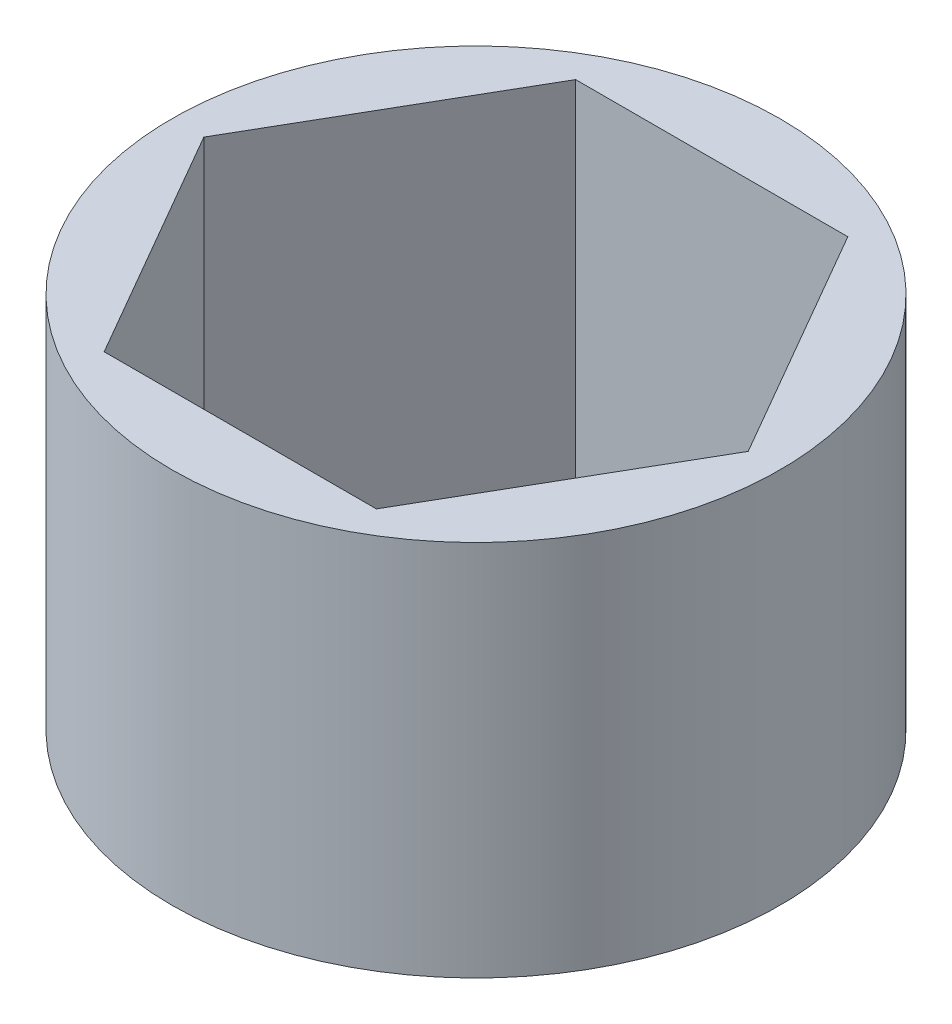
ISO-10303-21;
HEADER;
FILE_DESCRIPTION(('STEP AP214'),'2;1');
FILE_NAME('part.step','',(''),(''),'','','');
FILE_SCHEMA(('AUTOMOTIVE_DESIGN { 1 0 10303 214 1 1 1 1 }'));
ENDSEC;
DATA;
#1=APPLICATION_CONTEXT('core data for automotive mechanical design processes');
#2=APPLICATION_PROTOCOL_DEFINITION('international standard','automotive_design',2000,#1);
#3=PRODUCT_CONTEXT('',#1,'mechanical');
#4=PRODUCT('Part','Part','',(#3));
#5=PRODUCT_RELATED_PRODUCT_CATEGORY('part','',(#4));
#6=PRODUCT_DEFINITION_FORMATION('','',#4);
#7=PRODUCT_DEFINITION_CONTEXT('part definition',#1,'design');
#8=PRODUCT_DEFINITION('design','',#6,#7);
#9=PRODUCT_DEFINITION_SHAPE('','',#8);
#10=(LENGTH_UNIT() NAMED_UNIT(*) SI_UNIT(.MILLI.,.METRE.));
#11=(NAMED_UNIT(*) PLANE_ANGLE_UNIT() SI_UNIT($,.RADIAN.));
#12=(NAMED_UNIT(*) SI_UNIT($,.STERADIAN.) SOLID_ANGLE_UNIT());
#13=UNCERTAINTY_MEASURE_WITH_UNIT(LENGTH_MEASURE(1.E-05),#10,'distance_accuracy_value','');
#14=(GEOMETRIC_REPRESENTATION_CONTEXT(3) GLOBAL_UNCERTAINTY_ASSIGNED_CONTEXT((#13)) GLOBAL_UNIT_ASSIGNED_CONTEXT((#10,
#11,#12)) REPRESENTATION_CONTEXT('',''));
#15=CARTESIAN_POINT('',(0.,0.,0.));
#16=DIRECTION('',(0.,0.,1.));
#17=DIRECTION('',(1.,0.,0.));
#18=AXIS2_PLACEMENT_3D('',#15,#16,#17);
#19=CARTESIAN_POINT('',(0.,10.16,0.));
#20=DIRECTION('',(0.,1.,0.));
#21=DIRECTION('',(0.,0.,1.));
#22=AXIS2_PLACEMENT_3D('',#19,#20,#21);
#23=PLANE('',#22);
#24=CARTESIAN_POINT('',(0.,10.16,0.));
#25=DIRECTION('',(0.,1.,0.));
#26=DIRECTION('',(0.,0.,1.));
#27=AXIS2_PLACEMENT_3D('',#24,#25,#26);
#28=CIRCLE('',#27,8.1915);
#29=CARTESIAN_POINT('',(0.,10.16,8.1915));
#30=VERTEX_POINT('',#29);
#31=EDGE_CURVE('E11',#30,#30,#28,.T.);
#32=ORIENTED_EDGE('',*,*,#31,.T.);
#33=EDGE_LOOP('',(#32));
#34=FACE_BOUND('',#33,.T.);
#35=DIRECTION('',(-1.,0.,0.));
#36=VECTOR('',#35,1.);
#37=CARTESIAN_POINT('',(3.66617420935412,10.16,-6.35));
#38=LINE('',#37,#36);
#39=CARTESIAN_POINT('',(3.66617420935412,10.16,-6.35));
#40=VERTEX_POINT('',#39);
#41=CARTESIAN_POINT('',(-3.66617420935412,10.16,-6.35));
#42=VERTEX_POINT('',#41);
#43=EDGE_CURVE('E94',#40,#42,#38,.T.);
#44=ORIENTED_EDGE('',*,*,#43,.F.);
#45=DIRECTION('',(-0.5,0.,-0.866025403784438));
#46=VECTOR('',#45,1.);
#47=CARTESIAN_POINT('',(7.33234841870825,10.16,0.));
#48=LINE('',#47,#46);
#49=CARTESIAN_POINT('',(7.33234841870825,10.16,0.));
#50=VERTEX_POINT('',#49);
#51=EDGE_CURVE('E86',#50,#40,#48,.T.);
#52=ORIENTED_EDGE('',*,*,#51,.F.);
#53=DIRECTION('',(0.5,0.,-0.866025403784439));
#54=VECTOR('',#53,1.);
#55=CARTESIAN_POINT('',(3.66617420935412,10.16,6.35));
#56=LINE('',#55,#54);
#57=CARTESIAN_POINT('',(3.66617420935412,10.16,6.35));
#58=VERTEX_POINT('',#57);
#59=EDGE_CURVE('E114',#58,#50,#56,.T.);
#60=ORIENTED_EDGE('',*,*,#59,.F.);
#61=DIRECTION('',(1.,0.,0.));
#62=VECTOR('',#61,1.);
#63=CARTESIAN_POINT('',(-3.66617420935412,10.16,6.35));
#64=LINE('',#63,#62);
#65=CARTESIAN_POINT('',(-3.66617420935412,10.16,6.35));
#66=VERTEX_POINT('',#65);
#67=EDGE_CURVE('E112',#66,#58,#64,.T.);
#68=ORIENTED_EDGE('',*,*,#67,.F.);
#69=DIRECTION('',(0.5,0.,0.866025403784438));
#70=VECTOR('',#69,1.);
#71=CARTESIAN_POINT('',(-7.33234841870824,10.16,0.));
#72=LINE('',#71,#70);
#73=CARTESIAN_POINT('',(-7.33234841870824,10.16,0.));
#74=VERTEX_POINT('',#73);
#75=EDGE_CURVE('E108',#74,#66,#72,.T.);
#76=ORIENTED_EDGE('',*,*,#75,.F.);
#77=DIRECTION('',(-0.5,0.,0.866025403784439));
#78=VECTOR('',#77,1.);
#79=CARTESIAN_POINT('',(-3.66617420935412,10.16,-6.35));
#80=LINE('',#79,#78);
#81=EDGE_CURVE('E106',#42,#74,#80,.T.);
#82=ORIENTED_EDGE('',*,*,#81,.F.);
#83=EDGE_LOOP('',(#44,#52,#60,#68,#76,#82));
#84=FACE_BOUND('',#83,.T.);
#85=ADVANCED_FACE('F33',(#34,#84),#23,.T.);
#86=CARTESIAN_POINT('',(0.,0.,0.));
#87=DIRECTION('',(0.,1.,0.));
#88=DIRECTION('',(0.,0.,1.));
#89=AXIS2_PLACEMENT_3D('',#86,#87,#88);
#90=PLANE('',#89);
#91=CARTESIAN_POINT('',(0.,0.,0.));
#92=DIRECTION('',(0.,1.,0.));
#93=DIRECTION('',(0.,0.,1.));
#94=AXIS2_PLACEMENT_3D('',#91,#92,#93);
#95=CIRCLE('',#94,8.1915);
#96=CARTESIAN_POINT('',(0.,0.,8.1915));
#97=VERTEX_POINT('',#96);
#98=EDGE_CURVE('E37',#97,#97,#95,.T.);
#99=ORIENTED_EDGE('',*,*,#98,.F.);
#100=EDGE_LOOP('',(#99));
#101=FACE_BOUND('',#100,.T.);
#102=DIRECTION('',(-0.5,0.,-0.866025403784438));
#103=VECTOR('',#102,1.);
#104=CARTESIAN_POINT('',(7.33234841870825,0.,0.));
#105=LINE('',#104,#103);
#106=CARTESIAN_POINT('',(7.33234841870825,0.,0.));
#107=VERTEX_POINT('',#106);
#108=CARTESIAN_POINT('',(3.66617420935412,0.,-6.35));
#109=VERTEX_POINT('',#108);
#110=EDGE_CURVE('E56',#107,#109,#105,.T.);
#111=ORIENTED_EDGE('',*,*,#110,.T.);
#112=DIRECTION('',(-1.,0.,0.));
#113=VECTOR('',#112,1.);
#114=CARTESIAN_POINT('',(3.66617420935412,0.,-6.35));
#115=LINE('',#114,#113);
#116=CARTESIAN_POINT('',(-3.66617420935412,0.,-6.35));
#117=VERTEX_POINT('',#116);
#118=EDGE_CURVE('E101',#109,#117,#115,.T.);
#119=ORIENTED_EDGE('',*,*,#118,.T.);
#120=DIRECTION('',(-0.5,0.,0.866025403784439));
#121=VECTOR('',#120,1.);
#122=CARTESIAN_POINT('',(-3.66617420935412,0.,-6.35));
#123=LINE('',#122,#121);
#124=CARTESIAN_POINT('',(-7.33234841870824,0.,0.));
#125=VERTEX_POINT('',#124);
#126=EDGE_CURVE('E118',#117,#125,#123,.T.);
#127=ORIENTED_EDGE('',*,*,#126,.T.);
#128=DIRECTION('',(0.5,0.,0.866025403784438));
#129=VECTOR('',#128,1.);
#130=CARTESIAN_POINT('',(-7.33234841870824,0.,0.));
#131=LINE('',#130,#129);
#132=CARTESIAN_POINT('',(-3.66617420935412,0.,6.35));
#133=VERTEX_POINT('',#132);
#134=EDGE_CURVE('E121',#125,#133,#131,.T.);
#135=ORIENTED_EDGE('',*,*,#134,.T.);
#136=DIRECTION('',(1.,0.,0.));
#137=VECTOR('',#136,1.);
#138=CARTESIAN_POINT('',(-3.66617420935412,0.,6.35));
#139=LINE('',#138,#137);
#140=CARTESIAN_POINT('',(3.66617420935412,0.,6.35));
#141=VERTEX_POINT('',#140);
#142=EDGE_CURVE('E124',#133,#141,#139,.T.);
#143=ORIENTED_EDGE('',*,*,#142,.T.);
#144=DIRECTION('',(0.5,0.,-0.866025403784439));
#145=VECTOR('',#144,1.);
#146=CARTESIAN_POINT('',(3.66617420935412,0.,6.35));
#147=LINE('',#146,#145);
#148=EDGE_CURVE('E95',#141,#107,#147,.T.);
#149=ORIENTED_EDGE('',*,*,#148,.T.);
#150=EDGE_LOOP('',(#111,#119,#127,#135,#143,#149));
#151=FACE_BOUND('',#150,.T.);
#152=ADVANCED_FACE('F141',(#101,#151),#90,.F.);
#153=CARTESIAN_POINT('',(0.,10.16,0.));
#154=DIRECTION('',(0.,-1.,0.));
#155=DIRECTION('',(0.,0.,-1.));
#156=AXIS2_PLACEMENT_3D('',#153,#154,#155);
#157=CYLINDRICAL_SURFACE('',#156,8.1915);
#158=ORIENTED_EDGE('',*,*,#31,.F.);
#159=EDGE_LOOP('',(#158));
#160=FACE_BOUND('',#159,.T.);
#161=ORIENTED_EDGE('',*,*,#98,.T.);
#162=EDGE_LOOP('',(#161));
#163=FACE_BOUND('',#162,.T.);
#164=ADVANCED_FACE('F35',(#160,#163),#157,.T.);
#165=CARTESIAN_POINT('',(7.33234841870825,10.16,0.));
#166=DIRECTION('',(-0.866025403784439,0.,0.5));
#167=DIRECTION('',(0.5,0.,0.866025403784439));
#168=AXIS2_PLACEMENT_3D('',#165,#166,#167);
#169=PLANE('',#168);
#170=ORIENTED_EDGE('',*,*,#110,.F.);
#171=DIRECTION('',(0.,-1.,0.));
#172=VECTOR('',#171,1.);
#173=CARTESIAN_POINT('',(7.33234841870825,10.16,0.));
#174=LINE('',#173,#172);
#175=EDGE_CURVE('E90',#50,#107,#174,.T.);
#176=ORIENTED_EDGE('',*,*,#175,.F.);
#177=ORIENTED_EDGE('',*,*,#51,.T.);
#178=DIRECTION('',(0.,-1.,0.));
#179=VECTOR('',#178,1.);
#180=CARTESIAN_POINT('',(3.66617420935412,10.16,-6.35));
#181=LINE('',#180,#179);
#182=EDGE_CURVE('E89',#40,#109,#181,.T.);
#183=ORIENTED_EDGE('',*,*,#182,.T.);
#184=EDGE_LOOP('',(#170,#176,#177,#183));
#185=FACE_BOUND('',#184,.T.);
#186=ADVANCED_FACE('F88',(#185),#169,.T.);
#187=CARTESIAN_POINT('',(3.66617420935412,10.16,-6.35));
#188=DIRECTION('',(0.,0.,1.));
#189=DIRECTION('',(1.,0.,0.));
#190=AXIS2_PLACEMENT_3D('',#187,#188,#189);
#191=PLANE('',#190);
#192=ORIENTED_EDGE('',*,*,#118,.F.);
#193=ORIENTED_EDGE('',*,*,#182,.F.);
#194=ORIENTED_EDGE('',*,*,#43,.T.);
#195=DIRECTION('',(0.,-1.,0.));
#196=VECTOR('',#195,1.);
#197=CARTESIAN_POINT('',(-3.66617420935412,10.16,-6.35));
#198=LINE('',#197,#196);
#199=EDGE_CURVE('E102',#42,#117,#198,.T.);
#200=ORIENTED_EDGE('',*,*,#199,.T.);
#201=EDGE_LOOP('',(#192,#193,#194,#200));
#202=FACE_BOUND('',#201,.T.);
#203=ADVANCED_FACE('F98',(#202),#191,.T.);
#204=CARTESIAN_POINT('',(-3.66617420935412,10.16,-6.35));
#205=DIRECTION('',(0.866025403784439,0.,0.5));
#206=DIRECTION('',(0.5,0.,-0.866025403784439));
#207=AXIS2_PLACEMENT_3D('',#204,#205,#206);
#208=PLANE('',#207);
#209=ORIENTED_EDGE('',*,*,#126,.F.);
#210=ORIENTED_EDGE('',*,*,#199,.F.);
#211=ORIENTED_EDGE('',*,*,#81,.T.);
#212=DIRECTION('',(0.,-1.,0.));
#213=VECTOR('',#212,1.);
#214=CARTESIAN_POINT('',(-7.33234841870824,10.16,0.));
#215=LINE('',#214,#213);
#216=EDGE_CURVE('E133',#74,#125,#215,.T.);
#217=ORIENTED_EDGE('',*,*,#216,.T.);
#218=EDGE_LOOP('',(#209,#210,#211,#217));
#219=FACE_BOUND('',#218,.T.);
#220=ADVANCED_FACE('F137',(#219),#208,.T.);
#221=CARTESIAN_POINT('',(-7.33234841870824,10.16,0.));
#222=DIRECTION('',(0.866025403784438,0.,-0.5));
#223=DIRECTION('',(-0.5,0.,-0.866025403784438));
#224=AXIS2_PLACEMENT_3D('',#221,#222,#223);
#225=PLANE('',#224);
#226=ORIENTED_EDGE('',*,*,#134,.F.);
#227=ORIENTED_EDGE('',*,*,#216,.F.);
#228=ORIENTED_EDGE('',*,*,#75,.T.);
#229=DIRECTION('',(0.,-1.,0.));
#230=VECTOR('',#229,1.);
#231=CARTESIAN_POINT('',(-3.66617420935412,10.16,6.35));
#232=LINE('',#231,#230);
#233=EDGE_CURVE('E131',#66,#133,#232,.T.);
#234=ORIENTED_EDGE('',*,*,#233,.T.);
#235=EDGE_LOOP('',(#226,#227,#228,#234));
#236=FACE_BOUND('',#235,.T.);
#237=ADVANCED_FACE('F149',(#236),#225,.T.);
#238=CARTESIAN_POINT('',(-3.66617420935412,10.16,6.35));
#239=DIRECTION('',(0.,0.,-1.));
#240=DIRECTION('',(-1.,0.,0.));
#241=AXIS2_PLACEMENT_3D('',#238,#239,#240);
#242=PLANE('',#241);
#243=ORIENTED_EDGE('',*,*,#142,.F.);
#244=ORIENTED_EDGE('',*,*,#233,.F.);
#245=ORIENTED_EDGE('',*,*,#67,.T.);
#246=DIRECTION('',(0.,-1.,0.));
#247=VECTOR('',#246,1.);
#248=CARTESIAN_POINT('',(3.66617420935412,10.16,6.35));
#249=LINE('',#248,#247);
#250=EDGE_CURVE('E48',#58,#141,#249,.T.);
#251=ORIENTED_EDGE('',*,*,#250,.T.);
#252=EDGE_LOOP('',(#243,#244,#245,#251));
#253=FACE_BOUND('',#252,.T.);
#254=ADVANCED_FACE('F147',(#253),#242,.T.);
#255=CARTESIAN_POINT('',(3.66617420935412,10.16,6.35));
#256=DIRECTION('',(-0.866025403784439,0.,-0.5));
#257=DIRECTION('',(-0.5,0.,0.866025403784439));
#258=AXIS2_PLACEMENT_3D('',#255,#256,#257);
#259=PLANE('',#258);
#260=ORIENTED_EDGE('',*,*,#148,.F.);
#261=ORIENTED_EDGE('',*,*,#250,.F.);
#262=ORIENTED_EDGE('',*,*,#59,.T.);
#263=ORIENTED_EDGE('',*,*,#175,.T.);
#264=EDGE_LOOP('',(#260,#261,#262,#263));
#265=FACE_BOUND('',#264,.T.);
#266=ADVANCED_FACE('F143',(#265),#259,.T.);
#267=CLOSED_SHELL('',(#85,#152,#164,#186,#203,#220,#237,#254,#266));
#268=MANIFOLD_SOLID_BREP('B2',#267);
#269=ADVANCED_BREP_SHAPE_REPRESENTATION('',(#18,#268),#14);
#270=SHAPE_DEFINITION_REPRESENTATION(#9,#269);
ENDSEC;
END-ISO-10303-21;
